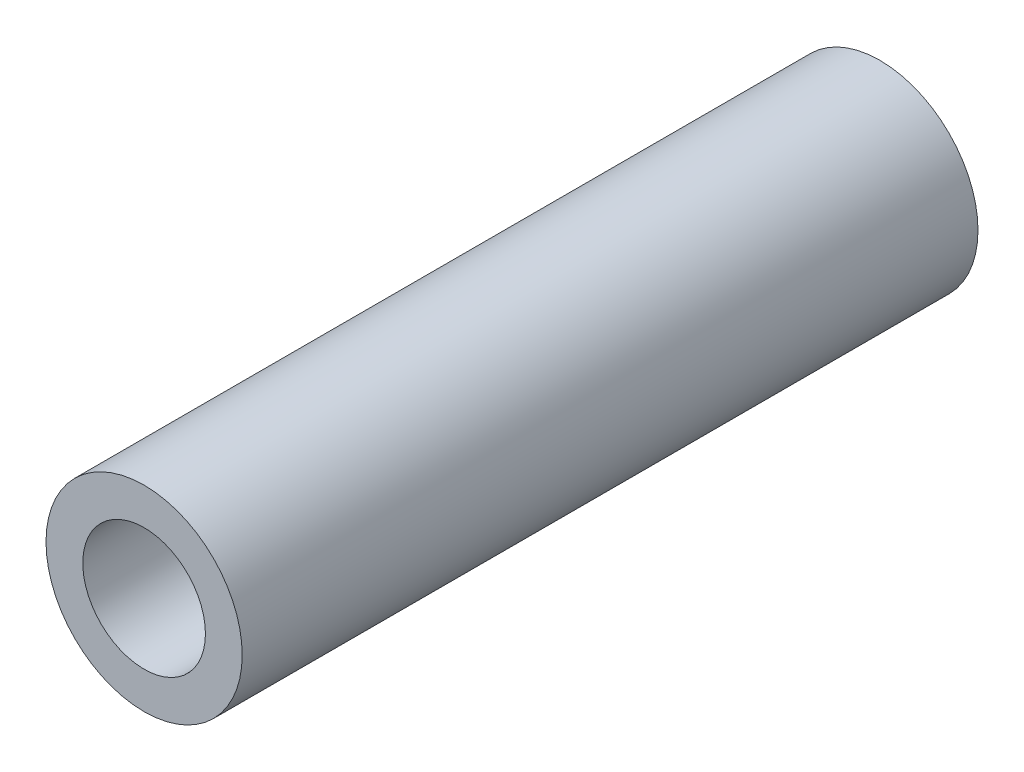
ISO-10303-21;
HEADER;
FILE_DESCRIPTION(('STEP AP214'),'2;1');
FILE_NAME('part.step','',(''),(''),'','','');
FILE_SCHEMA(('AUTOMOTIVE_DESIGN { 1 0 10303 214 1 1 1 1 }'));
ENDSEC;
DATA;
#1=APPLICATION_CONTEXT('core data for automotive mechanical design processes');
#2=APPLICATION_PROTOCOL_DEFINITION('international standard','automotive_design',2000,#1);
#3=PRODUCT_CONTEXT('',#1,'mechanical');
#4=PRODUCT('Part','Part','',(#3));
#5=PRODUCT_RELATED_PRODUCT_CATEGORY('part','',(#4));
#6=PRODUCT_DEFINITION_FORMATION('','',#4);
#7=PRODUCT_DEFINITION_CONTEXT('part definition',#1,'design');
#8=PRODUCT_DEFINITION('design','',#6,#7);
#9=PRODUCT_DEFINITION_SHAPE('','',#8);
#10=(LENGTH_UNIT() NAMED_UNIT(*) SI_UNIT(.MILLI.,.METRE.));
#11=(NAMED_UNIT(*) PLANE_ANGLE_UNIT() SI_UNIT($,.RADIAN.));
#12=(NAMED_UNIT(*) SI_UNIT($,.STERADIAN.) SOLID_ANGLE_UNIT());
#13=UNCERTAINTY_MEASURE_WITH_UNIT(LENGTH_MEASURE(1.E-05),#10,'distance_accuracy_value','');
#14=(GEOMETRIC_REPRESENTATION_CONTEXT(3) GLOBAL_UNCERTAINTY_ASSIGNED_CONTEXT((#13)) GLOBAL_UNIT_ASSIGNED_CONTEXT((#10,
#11,#12)) REPRESENTATION_CONTEXT('',''));
#15=CARTESIAN_POINT('',(0.,0.,0.));
#16=DIRECTION('',(0.,0.,1.));
#17=DIRECTION('',(1.,0.,0.));
#18=AXIS2_PLACEMENT_3D('',#15,#16,#17);
#19=CARTESIAN_POINT('',(0.,0.,12.));
#20=DIRECTION('',(0.,0.,1.));
#21=DIRECTION('',(1.,0.,0.));
#22=AXIS2_PLACEMENT_3D('',#19,#20,#21);
#23=PLANE('',#22);
#24=CARTESIAN_POINT('',(0.,0.,12.));
#25=DIRECTION('',(0.,0.,1.));
#26=DIRECTION('',(1.,0.,0.));
#27=AXIS2_PLACEMENT_3D('',#24,#25,#26);
#28=CIRCLE('',#27,1.6);
#29=CARTESIAN_POINT('',(1.6,0.,12.));
#30=VERTEX_POINT('',#29);
#31=EDGE_CURVE('E10',#30,#30,#28,.T.);
#32=ORIENTED_EDGE('',*,*,#31,.T.);
#33=EDGE_LOOP('',(#32));
#34=FACE_BOUND('',#33,.T.);
#35=CARTESIAN_POINT('',(0.,0.,12.));
#36=DIRECTION('',(0.,0.,1.));
#37=DIRECTION('',(1.,0.,0.));
#38=AXIS2_PLACEMENT_3D('',#35,#36,#37);
#39=CIRCLE('',#38,1.);
#40=CARTESIAN_POINT('',(1.,0.,12.));
#41=VERTEX_POINT('',#40);
#42=EDGE_CURVE('E43',#41,#41,#39,.T.);
#43=ORIENTED_EDGE('',*,*,#42,.F.);
#44=EDGE_LOOP('',(#43));
#45=FACE_BOUND('',#44,.T.);
#46=ADVANCED_FACE('F32',(#34,#45),#23,.T.);
#47=CARTESIAN_POINT('',(0.,0.,0.));
#48=DIRECTION('',(0.,0.,1.));
#49=DIRECTION('',(1.,0.,0.));
#50=AXIS2_PLACEMENT_3D('',#47,#48,#49);
#51=PLANE('',#50);
#52=CARTESIAN_POINT('',(0.,0.,0.));
#53=DIRECTION('',(0.,0.,1.));
#54=DIRECTION('',(1.,0.,0.));
#55=AXIS2_PLACEMENT_3D('',#52,#53,#54);
#56=CIRCLE('',#55,1.6);
#57=CARTESIAN_POINT('',(1.6,0.,0.));
#58=VERTEX_POINT('',#57);
#59=EDGE_CURVE('E36',#58,#58,#56,.T.);
#60=ORIENTED_EDGE('',*,*,#59,.F.);
#61=EDGE_LOOP('',(#60));
#62=FACE_BOUND('',#61,.T.);
#63=CARTESIAN_POINT('',(0.,0.,0.));
#64=DIRECTION('',(0.,0.,1.));
#65=DIRECTION('',(1.,0.,0.));
#66=AXIS2_PLACEMENT_3D('',#63,#64,#65);
#67=CIRCLE('',#66,1.);
#68=CARTESIAN_POINT('',(1.,0.,0.));
#69=VERTEX_POINT('',#68);
#70=EDGE_CURVE('E45',#69,#69,#67,.T.);
#71=ORIENTED_EDGE('',*,*,#70,.T.);
#72=EDGE_LOOP('',(#71));
#73=FACE_BOUND('',#72,.T.);
#74=ADVANCED_FACE('F55',(#62,#73),#51,.F.);
#75=CARTESIAN_POINT('',(0.,0.,12.));
#76=DIRECTION('',(0.,0.,-1.));
#77=DIRECTION('',(-1.,0.,0.));
#78=AXIS2_PLACEMENT_3D('',#75,#76,#77);
#79=CYLINDRICAL_SURFACE('',#78,1.6);
#80=ORIENTED_EDGE('',*,*,#31,.F.);
#81=EDGE_LOOP('',(#80));
#82=FACE_BOUND('',#81,.T.);
#83=ORIENTED_EDGE('',*,*,#59,.T.);
#84=EDGE_LOOP('',(#83));
#85=FACE_BOUND('',#84,.T.);
#86=ADVANCED_FACE('F34',(#82,#85),#79,.T.);
#87=CARTESIAN_POINT('',(0.,0.,12.));
#88=DIRECTION('',(0.,0.,-1.));
#89=DIRECTION('',(-1.,0.,0.));
#90=AXIS2_PLACEMENT_3D('',#87,#88,#89);
#91=CYLINDRICAL_SURFACE('',#90,1.);
#92=ORIENTED_EDGE('',*,*,#42,.T.);
#93=EDGE_LOOP('',(#92));
#94=FACE_BOUND('',#93,.T.);
#95=ORIENTED_EDGE('',*,*,#70,.F.);
#96=EDGE_LOOP('',(#95));
#97=FACE_BOUND('',#96,.T.);
#98=ADVANCED_FACE('F51',(#94,#97),#91,.F.);
#99=CLOSED_SHELL('',(#46,#74,#86,#98));
#100=MANIFOLD_SOLID_BREP('B2',#99);
#101=ADVANCED_BREP_SHAPE_REPRESENTATION('',(#18,#100),#14);
#102=SHAPE_DEFINITION_REPRESENTATION(#9,#101);
ENDSEC;
END-ISO-10303-21;
